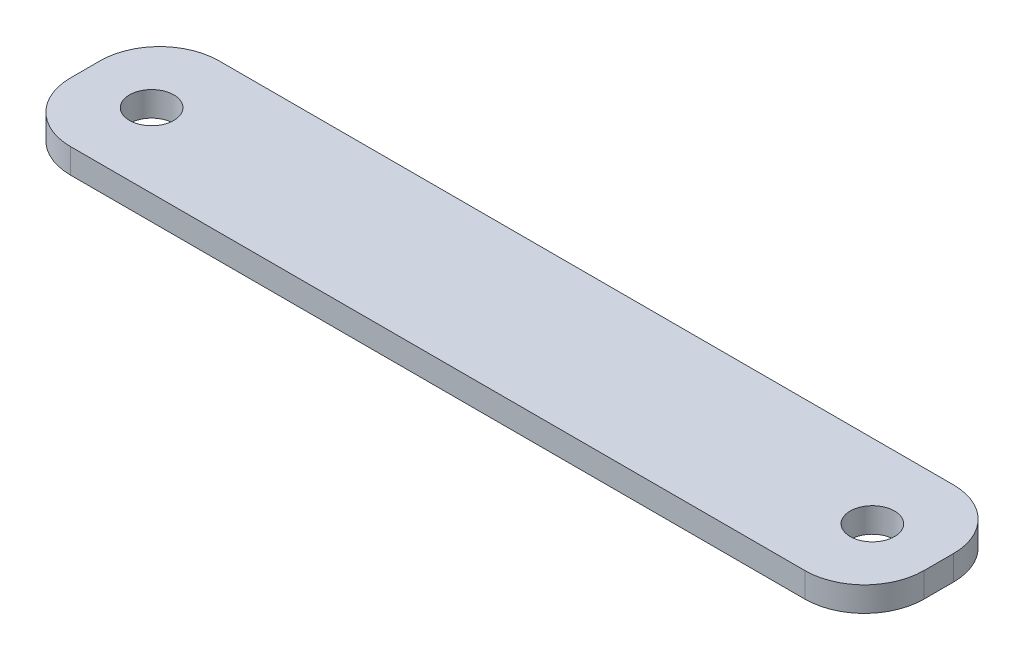
ISO-10303-21;
HEADER;
FILE_DESCRIPTION(('STEP AP214'),'2;1');
FILE_NAME('part.step','',(''),(''),'','','');
FILE_SCHEMA(('AUTOMOTIVE_DESIGN { 1 0 10303 214 1 1 1 1 }'));
ENDSEC;
DATA;
#1=APPLICATION_CONTEXT('core data for automotive mechanical design processes');
#2=APPLICATION_PROTOCOL_DEFINITION('international standard','automotive_design',2000,#1);
#3=PRODUCT_CONTEXT('',#1,'mechanical');
#4=PRODUCT('Part','Part','',(#3));
#5=PRODUCT_RELATED_PRODUCT_CATEGORY('part','',(#4));
#6=PRODUCT_DEFINITION_FORMATION('','',#4);
#7=PRODUCT_DEFINITION_CONTEXT('part definition',#1,'design');
#8=PRODUCT_DEFINITION('design','',#6,#7);
#9=PRODUCT_DEFINITION_SHAPE('','',#8);
#10=(LENGTH_UNIT() NAMED_UNIT(*) SI_UNIT(.MILLI.,.METRE.));
#11=(NAMED_UNIT(*) PLANE_ANGLE_UNIT() SI_UNIT($,.RADIAN.));
#12=(NAMED_UNIT(*) SI_UNIT($,.STERADIAN.) SOLID_ANGLE_UNIT());
#13=UNCERTAINTY_MEASURE_WITH_UNIT(LENGTH_MEASURE(1.E-05),#10,'distance_accuracy_value','');
#14=(GEOMETRIC_REPRESENTATION_CONTEXT(3) GLOBAL_UNCERTAINTY_ASSIGNED_CONTEXT((#13)) GLOBAL_UNIT_ASSIGNED_CONTEXT((#10,
#11,#12)) REPRESENTATION_CONTEXT('',''));
#15=CARTESIAN_POINT('',(0.,0.,0.));
#16=DIRECTION('',(0.,0.,1.));
#17=DIRECTION('',(1.,0.,0.));
#18=AXIS2_PLACEMENT_3D('',#15,#16,#17);
#19=CARTESIAN_POINT('',(0.,1.5875,0.));
#20=DIRECTION('',(1.,0.,0.));
#21=DIRECTION('',(0.,0.,-1.));
#22=AXIS2_PLACEMENT_3D('',#19,#20,#21);
#23=PLANE('',#22);
#24=DIRECTION('',(0.,0.,1.));
#25=VECTOR('',#24,1.);
#26=CARTESIAN_POINT('',(0.,1.5875,0.));
#27=LINE('',#26,#25);
#28=CARTESIAN_POINT('',(0.,1.5875,-5.715));
#29=VERTEX_POINT('',#28);
#30=CARTESIAN_POINT('',(0.,1.5875,-3.81));
#31=VERTEX_POINT('',#30);
#32=EDGE_CURVE('E127',#29,#31,#27,.T.);
#33=ORIENTED_EDGE('',*,*,#32,.F.);
#34=DIRECTION('',(0.,-1.,0.));
#35=VECTOR('',#34,1.);
#36=CARTESIAN_POINT('',(0.,1.5875,-5.715));
#37=LINE('',#36,#35);
#38=CARTESIAN_POINT('',(0.,0.,-5.715));
#39=VERTEX_POINT('',#38);
#40=EDGE_CURVE('E11',#29,#39,#37,.T.);
#41=ORIENTED_EDGE('',*,*,#40,.T.);
#42=DIRECTION('',(0.,0.,1.));
#43=VECTOR('',#42,1.);
#44=CARTESIAN_POINT('',(0.,0.,0.));
#45=LINE('',#44,#43);
#46=CARTESIAN_POINT('',(0.,0.,-3.81));
#47=VERTEX_POINT('',#46);
#48=EDGE_CURVE('E129',#39,#47,#45,.T.);
#49=ORIENTED_EDGE('',*,*,#48,.T.);
#50=DIRECTION('',(0.,-1.,0.));
#51=VECTOR('',#50,1.);
#52=CARTESIAN_POINT('',(0.,1.5875,-3.81));
#53=LINE('',#52,#51);
#54=EDGE_CURVE('E40',#47,#31,#53,.F.);
#55=ORIENTED_EDGE('',*,*,#54,.T.);
#56=EDGE_LOOP('',(#33,#41,#49,#55));
#57=FACE_BOUND('',#56,.T.);
#58=ADVANCED_FACE('F32',(#57),#23,.F.);
#59=CARTESIAN_POINT('',(0.,1.5875,0.));
#60=DIRECTION('',(0.,0.,-1.));
#61=DIRECTION('',(-1.,0.,0.));
#62=AXIS2_PLACEMENT_3D('',#59,#60,#61);
#63=PLANE('',#62);
#64=DIRECTION('',(1.,0.,0.));
#65=VECTOR('',#64,1.);
#66=CARTESIAN_POINT('',(0.,0.,0.));
#67=LINE('',#66,#65);
#68=CARTESIAN_POINT('',(3.81,0.,0.));
#69=VERTEX_POINT('',#68);
#70=CARTESIAN_POINT('',(50.927,0.,0.));
#71=VERTEX_POINT('',#70);
#72=EDGE_CURVE('E125',#69,#71,#67,.T.);
#73=ORIENTED_EDGE('',*,*,#72,.T.);
#74=DIRECTION('',(0.,-1.,0.));
#75=VECTOR('',#74,1.);
#76=CARTESIAN_POINT('',(50.927,1.5875,0.));
#77=LINE('',#76,#75);
#78=CARTESIAN_POINT('',(50.927,1.5875,0.));
#79=VERTEX_POINT('',#78);
#80=EDGE_CURVE('E104',#71,#79,#77,.F.);
#81=ORIENTED_EDGE('',*,*,#80,.T.);
#82=DIRECTION('',(1.,0.,0.));
#83=VECTOR('',#82,1.);
#84=CARTESIAN_POINT('',(0.,1.5875,0.));
#85=LINE('',#84,#83);
#86=CARTESIAN_POINT('',(3.81,1.5875,0.));
#87=VERTEX_POINT('',#86);
#88=EDGE_CURVE('E165',#87,#79,#85,.T.);
#89=ORIENTED_EDGE('',*,*,#88,.F.);
#90=DIRECTION('',(0.,-1.,0.));
#91=VECTOR('',#90,1.);
#92=CARTESIAN_POINT('',(3.81,1.5875,0.));
#93=LINE('',#92,#91);
#94=EDGE_CURVE('E109',#87,#69,#93,.T.);
#95=ORIENTED_EDGE('',*,*,#94,.T.);
#96=EDGE_LOOP('',(#73,#81,#89,#95));
#97=FACE_BOUND('',#96,.T.);
#98=ADVANCED_FACE('F169',(#97),#63,.F.);
#99=CARTESIAN_POINT('',(54.737,1.5875,0.));
#100=DIRECTION('',(-1.,0.,0.));
#101=DIRECTION('',(0.,0.,1.));
#102=AXIS2_PLACEMENT_3D('',#99,#100,#101);
#103=PLANE('',#102);
#104=DIRECTION('',(0.,0.,-1.));
#105=VECTOR('',#104,1.);
#106=CARTESIAN_POINT('',(54.737,1.5875,0.));
#107=LINE('',#106,#105);
#108=CARTESIAN_POINT('',(54.737,1.5875,-3.81));
#109=VERTEX_POINT('',#108);
#110=CARTESIAN_POINT('',(54.737,1.5875,-5.715));
#111=VERTEX_POINT('',#110);
#112=EDGE_CURVE('E118',#109,#111,#107,.T.);
#113=ORIENTED_EDGE('',*,*,#112,.F.);
#114=DIRECTION('',(0.,-1.,0.));
#115=VECTOR('',#114,1.);
#116=CARTESIAN_POINT('',(54.737,1.5875,-3.81));
#117=LINE('',#116,#115);
#118=CARTESIAN_POINT('',(54.737,0.,-3.81));
#119=VERTEX_POINT('',#118);
#120=EDGE_CURVE('E103',#109,#119,#117,.T.);
#121=ORIENTED_EDGE('',*,*,#120,.T.);
#122=DIRECTION('',(0.,0.,-1.));
#123=VECTOR('',#122,1.);
#124=CARTESIAN_POINT('',(54.737,0.,0.));
#125=LINE('',#124,#123);
#126=CARTESIAN_POINT('',(54.737,0.,-5.715));
#127=VERTEX_POINT('',#126);
#128=EDGE_CURVE('E116',#119,#127,#125,.T.);
#129=ORIENTED_EDGE('',*,*,#128,.T.);
#130=DIRECTION('',(0.,-1.,0.));
#131=VECTOR('',#130,1.);
#132=CARTESIAN_POINT('',(54.737,1.5875,-5.715));
#133=LINE('',#132,#131);
#134=EDGE_CURVE('E120',#127,#111,#133,.F.);
#135=ORIENTED_EDGE('',*,*,#134,.T.);
#136=EDGE_LOOP('',(#113,#121,#129,#135));
#137=FACE_BOUND('',#136,.T.);
#138=ADVANCED_FACE('F115',(#137),#103,.F.);
#139=CARTESIAN_POINT('',(0.,1.5875,-9.525));
#140=DIRECTION('',(0.,0.,1.));
#141=DIRECTION('',(1.,0.,0.));
#142=AXIS2_PLACEMENT_3D('',#139,#140,#141);
#143=PLANE('',#142);
#144=DIRECTION('',(-1.,0.,0.));
#145=VECTOR('',#144,1.);
#146=CARTESIAN_POINT('',(0.,1.5875,-9.525));
#147=LINE('',#146,#145);
#148=CARTESIAN_POINT('',(50.927,1.5875,-9.525));
#149=VERTEX_POINT('',#148);
#150=CARTESIAN_POINT('',(3.81,1.5875,-9.525));
#151=VERTEX_POINT('',#150);
#152=EDGE_CURVE('E133',#149,#151,#147,.T.);
#153=ORIENTED_EDGE('',*,*,#152,.F.);
#154=DIRECTION('',(0.,-1.,0.));
#155=VECTOR('',#154,1.);
#156=CARTESIAN_POINT('',(50.927,1.5875,-9.525));
#157=LINE('',#156,#155);
#158=CARTESIAN_POINT('',(50.927,0.,-9.525));
#159=VERTEX_POINT('',#158);
#160=EDGE_CURVE('E150',#149,#159,#157,.T.);
#161=ORIENTED_EDGE('',*,*,#160,.T.);
#162=DIRECTION('',(-1.,0.,0.));
#163=VECTOR('',#162,1.);
#164=CARTESIAN_POINT('',(0.,0.,-9.525));
#165=LINE('',#164,#163);
#166=CARTESIAN_POINT('',(3.81,0.,-9.525));
#167=VERTEX_POINT('',#166);
#168=EDGE_CURVE('E124',#159,#167,#165,.T.);
#169=ORIENTED_EDGE('',*,*,#168,.T.);
#170=DIRECTION('',(0.,-1.,0.));
#171=VECTOR('',#170,1.);
#172=CARTESIAN_POINT('',(3.81,1.5875,-9.525));
#173=LINE('',#172,#171);
#174=EDGE_CURVE('E47',#167,#151,#173,.F.);
#175=ORIENTED_EDGE('',*,*,#174,.T.);
#176=EDGE_LOOP('',(#153,#161,#169,#175));
#177=FACE_BOUND('',#176,.T.);
#178=ADVANCED_FACE('F198',(#177),#143,.F.);
#179=CARTESIAN_POINT('',(0.,1.5875,-9.525));
#180=DIRECTION('',(0.,-1.,0.));
#181=DIRECTION('',(0.,0.,-1.));
#182=AXIS2_PLACEMENT_3D('',#179,#180,#181);
#183=PLANE('',#182);
#184=CARTESIAN_POINT('',(50.4825,1.5875,-4.7625));
#185=DIRECTION('',(0.,1.,0.));
#186=DIRECTION('',(0.,0.,1.));
#187=AXIS2_PLACEMENT_3D('',#184,#185,#186);
#188=CIRCLE('',#187,1.42239999999999);
#189=CARTESIAN_POINT('',(50.4825,1.5875,-3.34010000000001));
#190=VERTEX_POINT('',#189);
#191=EDGE_CURVE('E181',#190,#190,#188,.T.);
#192=ORIENTED_EDGE('',*,*,#191,.F.);
#193=EDGE_LOOP('',(#192));
#194=FACE_BOUND('',#193,.T.);
#195=CARTESIAN_POINT('',(4.25449999999999,1.5875,-4.7625));
#196=DIRECTION('',(0.,1.,0.));
#197=DIRECTION('',(0.,0.,1.));
#198=AXIS2_PLACEMENT_3D('',#195,#196,#197);
#199=CIRCLE('',#198,1.4224);
#200=CARTESIAN_POINT('',(4.25449999999999,1.5875,-3.3401));
#201=VERTEX_POINT('',#200);
#202=EDGE_CURVE('E172',#201,#201,#199,.T.);
#203=ORIENTED_EDGE('',*,*,#202,.F.);
#204=EDGE_LOOP('',(#203));
#205=FACE_BOUND('',#204,.T.);
#206=ORIENTED_EDGE('',*,*,#88,.T.);
#207=CARTESIAN_POINT('',(50.927,1.5875,-3.81));
#208=DIRECTION('',(0.,-1.,0.));
#209=DIRECTION('',(0.,0.,-1.));
#210=AXIS2_PLACEMENT_3D('',#207,#208,#209);
#211=CIRCLE('',#210,3.81);
#212=EDGE_CURVE('E147',#79,#109,#211,.F.);
#213=ORIENTED_EDGE('',*,*,#212,.T.);
#214=ORIENTED_EDGE('',*,*,#112,.T.);
#215=CARTESIAN_POINT('',(50.927,1.5875,-5.715));
#216=DIRECTION('',(0.,-1.,0.));
#217=DIRECTION('',(0.,0.,-1.));
#218=AXIS2_PLACEMENT_3D('',#215,#216,#217);
#219=CIRCLE('',#218,3.81);
#220=EDGE_CURVE('E54',#111,#149,#219,.F.);
#221=ORIENTED_EDGE('',*,*,#220,.T.);
#222=ORIENTED_EDGE('',*,*,#152,.T.);
#223=CARTESIAN_POINT('',(3.81,1.5875,-5.715));
#224=DIRECTION('',(0.,-1.,0.));
#225=DIRECTION('',(0.,0.,-1.));
#226=AXIS2_PLACEMENT_3D('',#223,#224,#225);
#227=CIRCLE('',#226,3.81);
#228=EDGE_CURVE('E144',#151,#29,#227,.F.);
#229=ORIENTED_EDGE('',*,*,#228,.T.);
#230=ORIENTED_EDGE('',*,*,#32,.T.);
#231=CARTESIAN_POINT('',(3.81,1.5875,-3.81));
#232=DIRECTION('',(0.,-1.,0.));
#233=DIRECTION('',(0.,0.,-1.));
#234=AXIS2_PLACEMENT_3D('',#231,#232,#233);
#235=CIRCLE('',#234,3.81);
#236=EDGE_CURVE('E142',#31,#87,#235,.F.);
#237=ORIENTED_EDGE('',*,*,#236,.T.);
#238=EDGE_LOOP('',(#206,#213,#214,#221,#222,#229,#230,#237));
#239=FACE_BOUND('',#238,.T.);
#240=ADVANCED_FACE('F162',(#194,#205,#239),#183,.F.);
#241=CARTESIAN_POINT('',(0.,0.,-9.525));
#242=DIRECTION('',(0.,-1.,0.));
#243=DIRECTION('',(0.,0.,-1.));
#244=AXIS2_PLACEMENT_3D('',#241,#242,#243);
#245=PLANE('',#244);
#246=CARTESIAN_POINT('',(50.4825,0.,-4.7625));
#247=DIRECTION('',(0.,1.,0.));
#248=DIRECTION('',(0.,0.,1.));
#249=AXIS2_PLACEMENT_3D('',#246,#247,#248);
#250=CIRCLE('',#249,1.42239999999999);
#251=CARTESIAN_POINT('',(50.4825,0.,-3.34010000000001));
#252=VERTEX_POINT('',#251);
#253=EDGE_CURVE('E179',#252,#252,#250,.T.);
#254=ORIENTED_EDGE('',*,*,#253,.T.);
#255=EDGE_LOOP('',(#254));
#256=FACE_BOUND('',#255,.T.);
#257=CARTESIAN_POINT('',(4.25449999999999,0.,-4.7625));
#258=DIRECTION('',(0.,1.,0.));
#259=DIRECTION('',(0.,0.,1.));
#260=AXIS2_PLACEMENT_3D('',#257,#258,#259);
#261=CIRCLE('',#260,1.4224);
#262=CARTESIAN_POINT('',(4.25449999999999,0.,-3.3401));
#263=VERTEX_POINT('',#262);
#264=EDGE_CURVE('E170',#263,#263,#261,.T.);
#265=ORIENTED_EDGE('',*,*,#264,.T.);
#266=EDGE_LOOP('',(#265));
#267=FACE_BOUND('',#266,.T.);
#268=ORIENTED_EDGE('',*,*,#128,.F.);
#269=CARTESIAN_POINT('',(50.927,0.,-3.81));
#270=DIRECTION('',(0.,-1.,0.));
#271=DIRECTION('',(0.,0.,-1.));
#272=AXIS2_PLACEMENT_3D('',#269,#270,#271);
#273=CIRCLE('',#272,3.81);
#274=EDGE_CURVE('E99',#119,#71,#273,.T.);
#275=ORIENTED_EDGE('',*,*,#274,.T.);
#276=ORIENTED_EDGE('',*,*,#72,.F.);
#277=CARTESIAN_POINT('',(3.81,0.,-3.81));
#278=DIRECTION('',(0.,-1.,0.));
#279=DIRECTION('',(0.,0.,-1.));
#280=AXIS2_PLACEMENT_3D('',#277,#278,#279);
#281=CIRCLE('',#280,3.81);
#282=EDGE_CURVE('E119',#69,#47,#281,.T.);
#283=ORIENTED_EDGE('',*,*,#282,.T.);
#284=ORIENTED_EDGE('',*,*,#48,.F.);
#285=CARTESIAN_POINT('',(3.81,0.,-5.715));
#286=DIRECTION('',(0.,-1.,0.));
#287=DIRECTION('',(0.,0.,-1.));
#288=AXIS2_PLACEMENT_3D('',#285,#286,#287);
#289=CIRCLE('',#288,3.81);
#290=EDGE_CURVE('E136',#39,#167,#289,.T.);
#291=ORIENTED_EDGE('',*,*,#290,.T.);
#292=ORIENTED_EDGE('',*,*,#168,.F.);
#293=CARTESIAN_POINT('',(50.927,0.,-5.715));
#294=DIRECTION('',(0.,-1.,0.));
#295=DIRECTION('',(0.,0.,-1.));
#296=AXIS2_PLACEMENT_3D('',#293,#294,#295);
#297=CIRCLE('',#296,3.81);
#298=EDGE_CURVE('E110',#159,#127,#297,.T.);
#299=ORIENTED_EDGE('',*,*,#298,.T.);
#300=EDGE_LOOP('',(#268,#275,#276,#283,#284,#291,#292,#299));
#301=FACE_BOUND('',#300,.T.);
#302=ADVANCED_FACE('F122',(#256,#267,#301),#245,.T.);
#303=CARTESIAN_POINT('',(50.927,1.5875,-3.81));
#304=DIRECTION('',(0.,-1.,0.));
#305=DIRECTION('',(0.,0.,-1.));
#306=AXIS2_PLACEMENT_3D('',#303,#304,#305);
#307=CYLINDRICAL_SURFACE('',#306,3.81);
#308=ORIENTED_EDGE('',*,*,#212,.F.);
#309=ORIENTED_EDGE('',*,*,#80,.F.);
#310=ORIENTED_EDGE('',*,*,#274,.F.);
#311=ORIENTED_EDGE('',*,*,#120,.F.);
#312=EDGE_LOOP('',(#308,#309,#310,#311));
#313=FACE_BOUND('',#312,.T.);
#314=ADVANCED_FACE('F102',(#313),#307,.T.);
#315=CARTESIAN_POINT('',(50.927,1.5875,-5.715));
#316=DIRECTION('',(0.,-1.,0.));
#317=DIRECTION('',(0.,0.,-1.));
#318=AXIS2_PLACEMENT_3D('',#315,#316,#317);
#319=CYLINDRICAL_SURFACE('',#318,3.81);
#320=ORIENTED_EDGE('',*,*,#220,.F.);
#321=ORIENTED_EDGE('',*,*,#134,.F.);
#322=ORIENTED_EDGE('',*,*,#298,.F.);
#323=ORIENTED_EDGE('',*,*,#160,.F.);
#324=EDGE_LOOP('',(#320,#321,#322,#323));
#325=FACE_BOUND('',#324,.T.);
#326=ADVANCED_FACE('F220',(#325),#319,.T.);
#327=CARTESIAN_POINT('',(3.81,1.5875,-5.715));
#328=DIRECTION('',(0.,-1.,0.));
#329=DIRECTION('',(0.,0.,-1.));
#330=AXIS2_PLACEMENT_3D('',#327,#328,#329);
#331=CYLINDRICAL_SURFACE('',#330,3.81);
#332=ORIENTED_EDGE('',*,*,#228,.F.);
#333=ORIENTED_EDGE('',*,*,#174,.F.);
#334=ORIENTED_EDGE('',*,*,#290,.F.);
#335=ORIENTED_EDGE('',*,*,#40,.F.);
#336=EDGE_LOOP('',(#332,#333,#334,#335));
#337=FACE_BOUND('',#336,.T.);
#338=ADVANCED_FACE('F208',(#337),#331,.T.);
#339=CARTESIAN_POINT('',(3.81,1.5875,-3.81));
#340=DIRECTION('',(0.,-1.,0.));
#341=DIRECTION('',(0.,0.,-1.));
#342=AXIS2_PLACEMENT_3D('',#339,#340,#341);
#343=CYLINDRICAL_SURFACE('',#342,3.81);
#344=ORIENTED_EDGE('',*,*,#236,.F.);
#345=ORIENTED_EDGE('',*,*,#54,.F.);
#346=ORIENTED_EDGE('',*,*,#282,.F.);
#347=ORIENTED_EDGE('',*,*,#94,.F.);
#348=EDGE_LOOP('',(#344,#345,#346,#347));
#349=FACE_BOUND('',#348,.T.);
#350=ADVANCED_FACE('F34',(#349),#343,.T.);
#351=CARTESIAN_POINT('',(4.25449999999999,0.,-4.7625));
#352=DIRECTION('',(0.,1.,0.));
#353=DIRECTION('',(0.,0.,1.));
#354=AXIS2_PLACEMENT_3D('',#351,#352,#353);
#355=CYLINDRICAL_SURFACE('',#354,1.4224);
#356=ORIENTED_EDGE('',*,*,#264,.F.);
#357=EDGE_LOOP('',(#356));
#358=FACE_BOUND('',#357,.T.);
#359=ORIENTED_EDGE('',*,*,#202,.T.);
#360=EDGE_LOOP('',(#359));
#361=FACE_BOUND('',#360,.T.);
#362=ADVANCED_FACE('F192',(#358,#361),#355,.F.);
#363=CARTESIAN_POINT('',(50.4825,0.,-4.7625));
#364=DIRECTION('',(0.,1.,0.));
#365=DIRECTION('',(0.,0.,1.));
#366=AXIS2_PLACEMENT_3D('',#363,#364,#365);
#367=CYLINDRICAL_SURFACE('',#366,1.42239999999999);
#368=ORIENTED_EDGE('',*,*,#253,.F.);
#369=EDGE_LOOP('',(#368));
#370=FACE_BOUND('',#369,.T.);
#371=ORIENTED_EDGE('',*,*,#191,.T.);
#372=EDGE_LOOP('',(#371));
#373=FACE_BOUND('',#372,.T.);
#374=ADVANCED_FACE('F189',(#370,#373),#367,.F.);
#375=CLOSED_SHELL('',(#58,#98,#138,#178,#240,#302,#314,#326,#338,#350,#362,#374));
#376=MANIFOLD_SOLID_BREP('B2',#375);
#377=ADVANCED_BREP_SHAPE_REPRESENTATION('',(#18,#376),#14);
#378=SHAPE_DEFINITION_REPRESENTATION(#9,#377);
ENDSEC;
END-ISO-10303-21;
